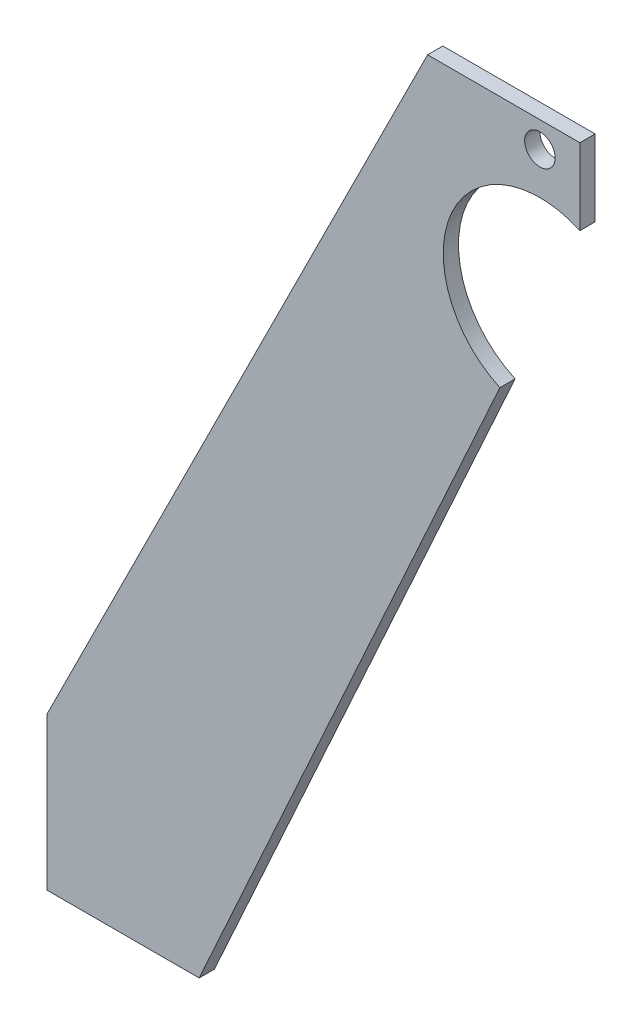
ISO-10303-21;
HEADER;
FILE_DESCRIPTION(('STEP AP214'),'2;1');
FILE_NAME('part.step','',(''),(''),'','','');
FILE_SCHEMA(('AUTOMOTIVE_DESIGN { 1 0 10303 214 1 1 1 1 }'));
ENDSEC;
DATA;
#1=APPLICATION_CONTEXT('core data for automotive mechanical design processes');
#2=APPLICATION_PROTOCOL_DEFINITION('international standard','automotive_design',2000,#1);
#3=PRODUCT_CONTEXT('',#1,'mechanical');
#4=PRODUCT('Part','Part','',(#3));
#5=PRODUCT_RELATED_PRODUCT_CATEGORY('part','',(#4));
#6=PRODUCT_DEFINITION_FORMATION('','',#4);
#7=PRODUCT_DEFINITION_CONTEXT('part definition',#1,'design');
#8=PRODUCT_DEFINITION('design','',#6,#7);
#9=PRODUCT_DEFINITION_SHAPE('','',#8);
#10=(LENGTH_UNIT() NAMED_UNIT(*) SI_UNIT(.MILLI.,.METRE.));
#11=(NAMED_UNIT(*) PLANE_ANGLE_UNIT() SI_UNIT($,.RADIAN.));
#12=(NAMED_UNIT(*) SI_UNIT($,.STERADIAN.) SOLID_ANGLE_UNIT());
#13=UNCERTAINTY_MEASURE_WITH_UNIT(LENGTH_MEASURE(1.E-05),#10,'distance_accuracy_value','');
#14=(GEOMETRIC_REPRESENTATION_CONTEXT(3) GLOBAL_UNCERTAINTY_ASSIGNED_CONTEXT((#13)) GLOBAL_UNIT_ASSIGNED_CONTEXT((#10,
#11,#12)) REPRESENTATION_CONTEXT('',''));
#15=CARTESIAN_POINT('',(0.,0.,0.));
#16=DIRECTION('',(0.,0.,1.));
#17=DIRECTION('',(1.,0.,0.));
#18=AXIS2_PLACEMENT_3D('',#15,#16,#17);
#19=CARTESIAN_POINT('',(129.495739548123,156.890627005871,4.));
#20=DIRECTION('',(0.,0.,1.));
#21=DIRECTION('',(1.,0.,0.));
#22=AXIS2_PLACEMENT_3D('',#19,#20,#21);
#23=PLANE('',#22);
#24=DIRECTION('',(-0.447213595499958,-0.894427190999916,0.));
#25=VECTOR('',#24,1.);
#26=CARTESIAN_POINT('',(100.,200.,4.));
#27=LINE('',#26,#25);
#28=CARTESIAN_POINT('',(100.,200.,4.));
#29=VERTEX_POINT('',#28);
#30=CARTESIAN_POINT('',(0.,0.,4.));
#31=VERTEX_POINT('',#30);
#32=EDGE_CURVE('E137',#29,#31,#27,.T.);
#33=ORIENTED_EDGE('',*,*,#32,.T.);
#34=DIRECTION('',(0.,-1.,0.));
#35=VECTOR('',#34,1.);
#36=CARTESIAN_POINT('',(0.,0.,4.));
#37=LINE('',#36,#35);
#38=CARTESIAN_POINT('',(0.,-40.,4.));
#39=VERTEX_POINT('',#38);
#40=EDGE_CURVE('E90',#31,#39,#37,.T.);
#41=ORIENTED_EDGE('',*,*,#40,.T.);
#42=DIRECTION('',(1.,0.,0.));
#43=VECTOR('',#42,1.);
#44=CARTESIAN_POINT('',(0.,-40.,4.));
#45=LINE('',#44,#43);
#46=CARTESIAN_POINT('',(40.,-40.,4.));
#47=VERTEX_POINT('',#46);
#48=EDGE_CURVE('E149',#39,#47,#45,.T.);
#49=ORIENTED_EDGE('',*,*,#48,.T.);
#50=DIRECTION('',(0.413802944301184,0.910366477462605,0.));
#51=VECTOR('',#50,1.);
#52=CARTESIAN_POINT('',(118.991479096246,133.781254011742,4.));
#53=LINE('',#52,#51);
#54=CARTESIAN_POINT('',(118.991479096246,133.781254011742,4.));
#55=VERTEX_POINT('',#54);
#56=EDGE_CURVE('E106',#47,#55,#53,.T.);
#57=ORIENTED_EDGE('',*,*,#56,.T.);
#58=CARTESIAN_POINT('',(129.495739548123,156.890627005871,4.));
#59=DIRECTION('',(0.,0.,-1.));
#60=DIRECTION('',(1.,0.,0.));
#61=AXIS2_PLACEMENT_3D('',#58,#59,#60);
#62=CIRCLE('',#61,25.384692391728);
#63=CARTESIAN_POINT('',(140.,180.,4.));
#64=VERTEX_POINT('',#63);
#65=EDGE_CURVE('E100',#55,#64,#62,.T.);
#66=ORIENTED_EDGE('',*,*,#65,.T.);
#67=DIRECTION('',(0.,1.,0.));
#68=VECTOR('',#67,1.);
#69=CARTESIAN_POINT('',(140.,200.,4.));
#70=LINE('',#69,#68);
#71=CARTESIAN_POINT('',(140.,200.,4.));
#72=VERTEX_POINT('',#71);
#73=EDGE_CURVE('E104',#64,#72,#70,.T.);
#74=ORIENTED_EDGE('',*,*,#73,.T.);
#75=DIRECTION('',(-1.,0.,0.));
#76=VECTOR('',#75,1.);
#77=CARTESIAN_POINT('',(140.,200.,4.));
#78=LINE('',#77,#76);
#79=EDGE_CURVE('E50',#72,#29,#78,.T.);
#80=ORIENTED_EDGE('',*,*,#79,.T.);
#81=EDGE_LOOP('',(#33,#41,#49,#57,#66,#74,#80));
#82=FACE_BOUND('',#81,.T.);
#83=CARTESIAN_POINT('',(129.495739548123,193.231222878561,4.));
#84=DIRECTION('',(0.,0.,1.));
#85=DIRECTION('',(1.,0.,0.));
#86=AXIS2_PLACEMENT_3D('',#83,#84,#85);
#87=CIRCLE('',#86,3.99999999999999);
#88=CARTESIAN_POINT('',(133.495739548123,193.231222878561,4.));
#89=VERTEX_POINT('',#88);
#90=EDGE_CURVE('E128',#89,#89,#87,.T.);
#91=ORIENTED_EDGE('',*,*,#90,.F.);
#92=EDGE_LOOP('',(#91));
#93=FACE_BOUND('',#92,.T.);
#94=ADVANCED_FACE('F33',(#82,#93),#23,.T.);
#95=CARTESIAN_POINT('',(129.495739548123,156.890627005871,0.));
#96=DIRECTION('',(0.,0.,1.));
#97=DIRECTION('',(1.,0.,0.));
#98=AXIS2_PLACEMENT_3D('',#95,#96,#97);
#99=PLANE('',#98);
#100=DIRECTION('',(-0.447213595499958,-0.894427190999916,0.));
#101=VECTOR('',#100,1.);
#102=CARTESIAN_POINT('',(100.,200.,0.));
#103=LINE('',#102,#101);
#104=CARTESIAN_POINT('',(100.,200.,0.));
#105=VERTEX_POINT('',#104);
#106=CARTESIAN_POINT('',(0.,0.,0.));
#107=VERTEX_POINT('',#106);
#108=EDGE_CURVE('E124',#105,#107,#103,.T.);
#109=ORIENTED_EDGE('',*,*,#108,.F.);
#110=DIRECTION('',(-1.,0.,0.));
#111=VECTOR('',#110,1.);
#112=CARTESIAN_POINT('',(140.,200.,0.));
#113=LINE('',#112,#111);
#114=CARTESIAN_POINT('',(140.,200.,0.));
#115=VERTEX_POINT('',#114);
#116=EDGE_CURVE('E82',#115,#105,#113,.T.);
#117=ORIENTED_EDGE('',*,*,#116,.F.);
#118=DIRECTION('',(0.,1.,0.));
#119=VECTOR('',#118,1.);
#120=CARTESIAN_POINT('',(140.,200.,0.));
#121=LINE('',#120,#119);
#122=CARTESIAN_POINT('',(140.,180.,0.));
#123=VERTEX_POINT('',#122);
#124=EDGE_CURVE('E76',#123,#115,#121,.T.);
#125=ORIENTED_EDGE('',*,*,#124,.F.);
#126=CARTESIAN_POINT('',(129.495739548123,156.890627005871,0.));
#127=DIRECTION('',(0.,0.,-1.));
#128=DIRECTION('',(1.,0.,0.));
#129=AXIS2_PLACEMENT_3D('',#126,#127,#128);
#130=CIRCLE('',#129,25.384692391728);
#131=CARTESIAN_POINT('',(118.991479096246,133.781254011742,0.));
#132=VERTEX_POINT('',#131);
#133=EDGE_CURVE('E114',#132,#123,#130,.T.);
#134=ORIENTED_EDGE('',*,*,#133,.F.);
#135=DIRECTION('',(0.413802944301184,0.910366477462605,0.));
#136=VECTOR('',#135,1.);
#137=CARTESIAN_POINT('',(118.991479096246,133.781254011742,0.));
#138=LINE('',#137,#136);
#139=CARTESIAN_POINT('',(40.,-40.,0.));
#140=VERTEX_POINT('',#139);
#141=EDGE_CURVE('E132',#140,#132,#138,.T.);
#142=ORIENTED_EDGE('',*,*,#141,.F.);
#143=DIRECTION('',(1.,0.,0.));
#144=VECTOR('',#143,1.);
#145=CARTESIAN_POINT('',(0.,-40.,0.));
#146=LINE('',#145,#144);
#147=CARTESIAN_POINT('',(0.,-40.,0.));
#148=VERTEX_POINT('',#147);
#149=EDGE_CURVE('E130',#148,#140,#146,.T.);
#150=ORIENTED_EDGE('',*,*,#149,.F.);
#151=DIRECTION('',(0.,-1.,0.));
#152=VECTOR('',#151,1.);
#153=CARTESIAN_POINT('',(0.,0.,0.));
#154=LINE('',#153,#152);
#155=EDGE_CURVE('E127',#107,#148,#154,.T.);
#156=ORIENTED_EDGE('',*,*,#155,.F.);
#157=EDGE_LOOP('',(#109,#117,#125,#134,#142,#150,#156));
#158=FACE_BOUND('',#157,.T.);
#159=CARTESIAN_POINT('',(129.495739548123,193.231222878561,0.));
#160=DIRECTION('',(0.,0.,1.));
#161=DIRECTION('',(1.,0.,0.));
#162=AXIS2_PLACEMENT_3D('',#159,#160,#161);
#163=CIRCLE('',#162,3.99999999999999);
#164=CARTESIAN_POINT('',(133.495739548123,193.231222878561,0.));
#165=VERTEX_POINT('',#164);
#166=EDGE_CURVE('E161',#165,#165,#163,.T.);
#167=ORIENTED_EDGE('',*,*,#166,.T.);
#168=EDGE_LOOP('',(#167));
#169=FACE_BOUND('',#168,.T.);
#170=ADVANCED_FACE('F153',(#158,#169),#99,.F.);
#171=CARTESIAN_POINT('',(100.,200.,4.));
#172=DIRECTION('',(0.894427190999916,-0.447213595499958,0.));
#173=DIRECTION('',(0.447213595499958,0.894427190999916,0.));
#174=AXIS2_PLACEMENT_3D('',#171,#172,#173);
#175=PLANE('',#174);
#176=ORIENTED_EDGE('',*,*,#108,.T.);
#177=DIRECTION('',(0.,0.,-1.));
#178=VECTOR('',#177,1.);
#179=CARTESIAN_POINT('',(0.,0.,4.));
#180=LINE('',#179,#178);
#181=EDGE_CURVE('E11',#31,#107,#180,.T.);
#182=ORIENTED_EDGE('',*,*,#181,.F.);
#183=ORIENTED_EDGE('',*,*,#32,.F.);
#184=DIRECTION('',(0.,0.,-1.));
#185=VECTOR('',#184,1.);
#186=CARTESIAN_POINT('',(100.,200.,4.));
#187=LINE('',#186,#185);
#188=EDGE_CURVE('E120',#29,#105,#187,.T.);
#189=ORIENTED_EDGE('',*,*,#188,.T.);
#190=EDGE_LOOP('',(#176,#182,#183,#189));
#191=FACE_BOUND('',#190,.T.);
#192=ADVANCED_FACE('F35',(#191),#175,.F.);
#193=CARTESIAN_POINT('',(0.,0.,4.));
#194=DIRECTION('',(1.,0.,0.));
#195=DIRECTION('',(0.,0.,-1.));
#196=AXIS2_PLACEMENT_3D('',#193,#194,#195);
#197=PLANE('',#196);
#198=ORIENTED_EDGE('',*,*,#155,.T.);
#199=DIRECTION('',(0.,0.,-1.));
#200=VECTOR('',#199,1.);
#201=CARTESIAN_POINT('',(0.,-40.,4.));
#202=LINE('',#201,#200);
#203=EDGE_CURVE('E42',#39,#148,#202,.T.);
#204=ORIENTED_EDGE('',*,*,#203,.F.);
#205=ORIENTED_EDGE('',*,*,#40,.F.);
#206=ORIENTED_EDGE('',*,*,#181,.T.);
#207=EDGE_LOOP('',(#198,#204,#205,#206));
#208=FACE_BOUND('',#207,.T.);
#209=ADVANCED_FACE('F187',(#208),#197,.F.);
#210=CARTESIAN_POINT('',(0.,-40.,4.));
#211=DIRECTION('',(0.,1.,0.));
#212=DIRECTION('',(0.,0.,1.));
#213=AXIS2_PLACEMENT_3D('',#210,#211,#212);
#214=PLANE('',#213);
#215=ORIENTED_EDGE('',*,*,#149,.T.);
#216=DIRECTION('',(0.,0.,-1.));
#217=VECTOR('',#216,1.);
#218=CARTESIAN_POINT('',(40.,-40.,4.));
#219=LINE('',#218,#217);
#220=EDGE_CURVE('E141',#47,#140,#219,.T.);
#221=ORIENTED_EDGE('',*,*,#220,.F.);
#222=ORIENTED_EDGE('',*,*,#48,.F.);
#223=ORIENTED_EDGE('',*,*,#203,.T.);
#224=EDGE_LOOP('',(#215,#221,#222,#223));
#225=FACE_BOUND('',#224,.T.);
#226=ADVANCED_FACE('F147',(#225),#214,.F.);
#227=CARTESIAN_POINT('',(118.991479096246,133.781254011742,4.));
#228=DIRECTION('',(-0.910366477462605,0.413802944301184,0.));
#229=DIRECTION('',(-0.413802944301184,-0.910366477462605,0.));
#230=AXIS2_PLACEMENT_3D('',#227,#228,#229);
#231=PLANE('',#230);
#232=ORIENTED_EDGE('',*,*,#141,.T.);
#233=DIRECTION('',(0.,0.,-1.));
#234=VECTOR('',#233,1.);
#235=CARTESIAN_POINT('',(118.991479096246,133.781254011742,4.));
#236=LINE('',#235,#234);
#237=EDGE_CURVE('E115',#55,#132,#236,.T.);
#238=ORIENTED_EDGE('',*,*,#237,.F.);
#239=ORIENTED_EDGE('',*,*,#56,.F.);
#240=ORIENTED_EDGE('',*,*,#220,.T.);
#241=EDGE_LOOP('',(#232,#238,#239,#240));
#242=FACE_BOUND('',#241,.T.);
#243=ADVANCED_FACE('F156',(#242),#231,.F.);
#244=CARTESIAN_POINT('',(129.495739548123,156.890627005871,4.));
#245=DIRECTION('',(0.,0.,-1.));
#246=DIRECTION('',(-1.,0.,0.));
#247=AXIS2_PLACEMENT_3D('',#244,#245,#246);
#248=CYLINDRICAL_SURFACE('',#247,25.384692391728);
#249=ORIENTED_EDGE('',*,*,#133,.T.);
#250=DIRECTION('',(0.,0.,-1.));
#251=VECTOR('',#250,1.);
#252=CARTESIAN_POINT('',(140.,180.,4.));
#253=LINE('',#252,#251);
#254=EDGE_CURVE('E111',#64,#123,#253,.T.);
#255=ORIENTED_EDGE('',*,*,#254,.F.);
#256=ORIENTED_EDGE('',*,*,#65,.F.);
#257=ORIENTED_EDGE('',*,*,#237,.T.);
#258=EDGE_LOOP('',(#249,#255,#256,#257));
#259=FACE_BOUND('',#258,.T.);
#260=ADVANCED_FACE('F112',(#259),#248,.F.);
#261=CARTESIAN_POINT('',(140.,200.,4.));
#262=DIRECTION('',(-1.,0.,0.));
#263=DIRECTION('',(0.,0.,1.));
#264=AXIS2_PLACEMENT_3D('',#261,#262,#263);
#265=PLANE('',#264);
#266=ORIENTED_EDGE('',*,*,#124,.T.);
#267=DIRECTION('',(0.,0.,-1.));
#268=VECTOR('',#267,1.);
#269=CARTESIAN_POINT('',(140.,200.,4.));
#270=LINE('',#269,#268);
#271=EDGE_CURVE('E116',#72,#115,#270,.T.);
#272=ORIENTED_EDGE('',*,*,#271,.F.);
#273=ORIENTED_EDGE('',*,*,#73,.F.);
#274=ORIENTED_EDGE('',*,*,#254,.T.);
#275=EDGE_LOOP('',(#266,#272,#273,#274));
#276=FACE_BOUND('',#275,.T.);
#277=ADVANCED_FACE('F118',(#276),#265,.F.);
#278=CARTESIAN_POINT('',(140.,200.,4.));
#279=DIRECTION('',(0.,-1.,0.));
#280=DIRECTION('',(0.,0.,-1.));
#281=AXIS2_PLACEMENT_3D('',#278,#279,#280);
#282=PLANE('',#281);
#283=ORIENTED_EDGE('',*,*,#116,.T.);
#284=ORIENTED_EDGE('',*,*,#188,.F.);
#285=ORIENTED_EDGE('',*,*,#79,.F.);
#286=ORIENTED_EDGE('',*,*,#271,.T.);
#287=EDGE_LOOP('',(#283,#284,#285,#286));
#288=FACE_BOUND('',#287,.T.);
#289=ADVANCED_FACE('F177',(#288),#282,.F.);
#290=CARTESIAN_POINT('',(129.495739548123,193.231222878561,4.));
#291=DIRECTION('',(0.,0.,-1.));
#292=DIRECTION('',(-1.,0.,0.));
#293=AXIS2_PLACEMENT_3D('',#290,#291,#292);
#294=CYLINDRICAL_SURFACE('',#293,3.99999999999999);
#295=ORIENTED_EDGE('',*,*,#90,.T.);
#296=EDGE_LOOP('',(#295));
#297=FACE_BOUND('',#296,.T.);
#298=ORIENTED_EDGE('',*,*,#166,.F.);
#299=EDGE_LOOP('',(#298));
#300=FACE_BOUND('',#299,.T.);
#301=ADVANCED_FACE('F167',(#297,#300),#294,.F.);
#302=CLOSED_SHELL('',(#94,#170,#192,#209,#226,#243,#260,#277,#289,#301));
#303=MANIFOLD_SOLID_BREP('B2',#302);
#304=ADVANCED_BREP_SHAPE_REPRESENTATION('',(#18,#303),#14);
#305=SHAPE_DEFINITION_REPRESENTATION(#9,#304);
ENDSEC;
END-ISO-10303-21;
